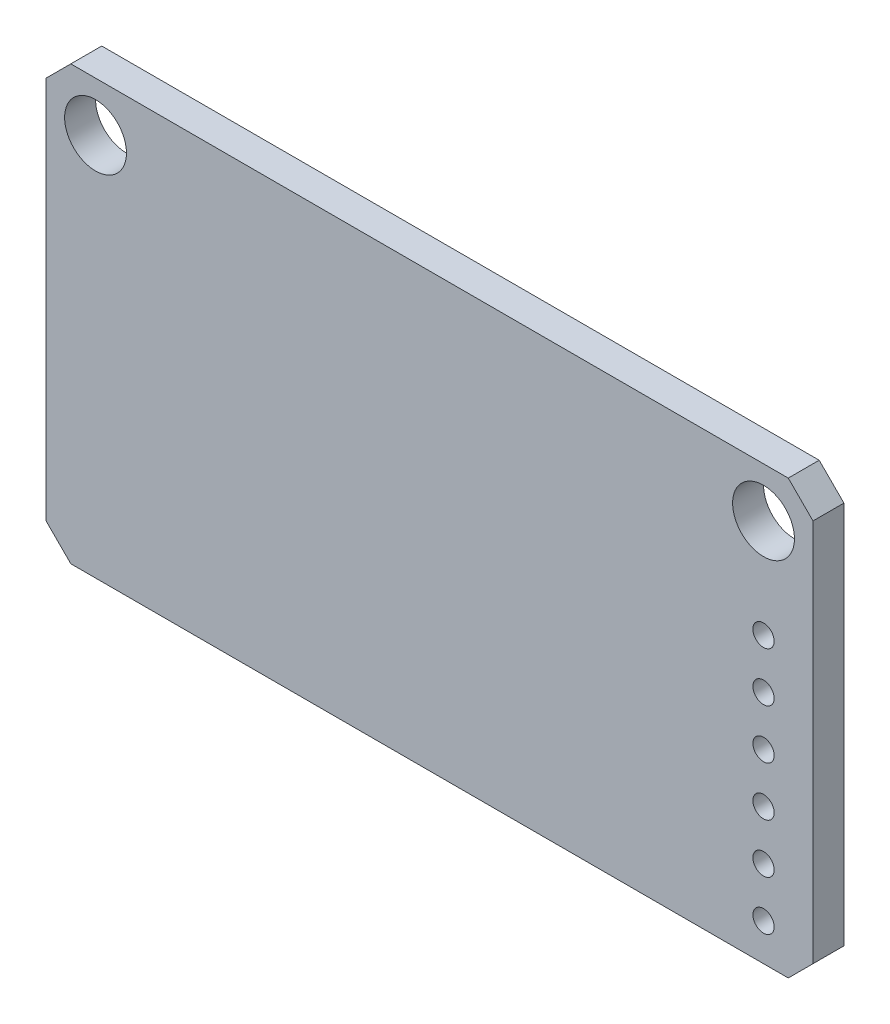
ISO-10303-21;
HEADER;
FILE_DESCRIPTION(('STEP AP214'),'2;1');
FILE_NAME('part.step','',(''),(''),'','','');
FILE_SCHEMA(('AUTOMOTIVE_DESIGN { 1 0 10303 214 1 1 1 1 }'));
ENDSEC;
DATA;
#1=APPLICATION_CONTEXT('core data for automotive mechanical design processes');
#2=APPLICATION_PROTOCOL_DEFINITION('international standard','automotive_design',2000,#1);
#3=PRODUCT_CONTEXT('',#1,'mechanical');
#4=PRODUCT('Part','Part','',(#3));
#5=PRODUCT_RELATED_PRODUCT_CATEGORY('part','',(#4));
#6=PRODUCT_DEFINITION_FORMATION('','',#4);
#7=PRODUCT_DEFINITION_CONTEXT('part definition',#1,'design');
#8=PRODUCT_DEFINITION('design','',#6,#7);
#9=PRODUCT_DEFINITION_SHAPE('','',#8);
#10=(LENGTH_UNIT() NAMED_UNIT(*) SI_UNIT(.MILLI.,.METRE.));
#11=(NAMED_UNIT(*) PLANE_ANGLE_UNIT() SI_UNIT($,.RADIAN.));
#12=(NAMED_UNIT(*) SI_UNIT($,.STERADIAN.) SOLID_ANGLE_UNIT());
#13=UNCERTAINTY_MEASURE_WITH_UNIT(LENGTH_MEASURE(1.E-05),#10,'distance_accuracy_value','');
#14=(GEOMETRIC_REPRESENTATION_CONTEXT(3) GLOBAL_UNCERTAINTY_ASSIGNED_CONTEXT((#13)) GLOBAL_UNIT_ASSIGNED_CONTEXT((#10,
#11,#12)) REPRESENTATION_CONTEXT('',''));
#15=CARTESIAN_POINT('',(0.,0.,0.));
#16=DIRECTION('',(0.,0.,1.));
#17=DIRECTION('',(1.,0.,0.));
#18=AXIS2_PLACEMENT_3D('',#15,#16,#17);
#19=CARTESIAN_POINT('',(0.,22.225,0.));
#20=DIRECTION('',(0.,0.,-1.));
#21=DIRECTION('',(-1.,0.,0.));
#22=AXIS2_PLACEMENT_3D('',#19,#20,#21);
#23=PLANE('',#22);
#24=DIRECTION('',(0.707106781186548,-0.707106781186548,0.));
#25=VECTOR('',#24,1.);
#26=CARTESIAN_POINT('',(0.,1.27,0.));
#27=LINE('',#26,#25);
#28=CARTESIAN_POINT('',(1.27,0.,0.));
#29=VERTEX_POINT('',#28);
#30=CARTESIAN_POINT('',(0.,1.27,0.));
#31=VERTEX_POINT('',#30);
#32=EDGE_CURVE('E412',#29,#31,#27,.F.);
#33=ORIENTED_EDGE('',*,*,#32,.F.);
#34=DIRECTION('',(1.,0.,0.));
#35=VECTOR('',#34,1.);
#36=CARTESIAN_POINT('',(1.27,0.,0.));
#37=LINE('',#36,#35);
#38=CARTESIAN_POINT('',(38.1,0.,0.));
#39=VERTEX_POINT('',#38);
#40=EDGE_CURVE('E417',#39,#29,#37,.F.);
#41=ORIENTED_EDGE('',*,*,#40,.F.);
#42=DIRECTION('',(0.707106781186548,0.707106781186547,0.));
#43=VECTOR('',#42,1.);
#44=CARTESIAN_POINT('',(38.1,0.,0.));
#45=LINE('',#44,#43);
#46=CARTESIAN_POINT('',(39.37,1.27,0.));
#47=VERTEX_POINT('',#46);
#48=EDGE_CURVE('E422',#47,#39,#45,.F.);
#49=ORIENTED_EDGE('',*,*,#48,.F.);
#50=DIRECTION('',(0.,1.,0.));
#51=VECTOR('',#50,1.);
#52=CARTESIAN_POINT('',(39.37,1.27,0.));
#53=LINE('',#52,#51);
#54=CARTESIAN_POINT('',(39.37,20.955,0.));
#55=VERTEX_POINT('',#54);
#56=EDGE_CURVE('E428',#55,#47,#53,.F.);
#57=ORIENTED_EDGE('',*,*,#56,.F.);
#58=DIRECTION('',(-0.707106781186548,0.707106781186548,0.));
#59=VECTOR('',#58,1.);
#60=CARTESIAN_POINT('',(38.1,22.225,0.));
#61=LINE('',#60,#59);
#62=CARTESIAN_POINT('',(38.1,22.225,0.));
#63=VERTEX_POINT('',#62);
#64=EDGE_CURVE('E432',#63,#55,#61,.F.);
#65=ORIENTED_EDGE('',*,*,#64,.F.);
#66=DIRECTION('',(-1.,0.,0.));
#67=VECTOR('',#66,1.);
#68=CARTESIAN_POINT('',(1.27,22.225,0.));
#69=LINE('',#68,#67);
#70=CARTESIAN_POINT('',(1.27,22.225,0.));
#71=VERTEX_POINT('',#70);
#72=EDGE_CURVE('E79',#71,#63,#69,.F.);
#73=ORIENTED_EDGE('',*,*,#72,.F.);
#74=DIRECTION('',(-0.707106781186547,-0.707106781186548,0.));
#75=VECTOR('',#74,1.);
#76=CARTESIAN_POINT('',(0.,20.955,0.));
#77=LINE('',#76,#75);
#78=CARTESIAN_POINT('',(0.,20.955,0.));
#79=VERTEX_POINT('',#78);
#80=EDGE_CURVE('E81',#79,#71,#77,.F.);
#81=ORIENTED_EDGE('',*,*,#80,.F.);
#82=DIRECTION('',(0.,-1.,0.));
#83=VECTOR('',#82,1.);
#84=CARTESIAN_POINT('',(0.,1.27,0.));
#85=LINE('',#84,#83);
#86=EDGE_CURVE('E84',#31,#79,#85,.F.);
#87=ORIENTED_EDGE('',*,*,#86,.F.);
#88=EDGE_LOOP('',(#33,#41,#49,#57,#65,#73,#81,#87));
#89=FACE_BOUND('',#88,.T.);
#90=CARTESIAN_POINT('',(2.54,19.685,0.));
#91=DIRECTION('',(0.,0.,1.));
#92=DIRECTION('',(1.,0.,0.));
#93=AXIS2_PLACEMENT_3D('',#90,#91,#92);
#94=CIRCLE('',#93,1.5875);
#95=CARTESIAN_POINT('',(4.1275,19.685,0.));
#96=VERTEX_POINT('',#95);
#97=EDGE_CURVE('E97',#96,#96,#94,.F.);
#98=ORIENTED_EDGE('',*,*,#97,.T.);
#99=EDGE_LOOP('',(#98));
#100=FACE_BOUND('',#99,.T.);
#101=CARTESIAN_POINT('',(36.83,19.685,0.));
#102=DIRECTION('',(0.,0.,1.));
#103=DIRECTION('',(1.,0.,0.));
#104=AXIS2_PLACEMENT_3D('',#101,#102,#103);
#105=CIRCLE('',#104,1.5875);
#106=CARTESIAN_POINT('',(38.4175,19.685,0.));
#107=VERTEX_POINT('',#106);
#108=EDGE_CURVE('E135',#107,#107,#105,.F.);
#109=ORIENTED_EDGE('',*,*,#108,.T.);
#110=EDGE_LOOP('',(#109));
#111=FACE_BOUND('',#110,.T.);
#112=CARTESIAN_POINT('',(36.83,1.905,0.));
#113=DIRECTION('',(0.,0.,1.));
#114=DIRECTION('',(1.,0.,0.));
#115=AXIS2_PLACEMENT_3D('',#112,#113,#114);
#116=CIRCLE('',#115,0.546100000000001);
#117=CARTESIAN_POINT('',(37.3761,1.905,0.));
#118=VERTEX_POINT('',#117);
#119=EDGE_CURVE('E138',#118,#118,#116,.F.);
#120=ORIENTED_EDGE('',*,*,#119,.T.);
#121=EDGE_LOOP('',(#120));
#122=FACE_BOUND('',#121,.T.);
#123=CARTESIAN_POINT('',(36.83,4.445,0.));
#124=DIRECTION('',(0.,0.,1.));
#125=DIRECTION('',(1.,0.,0.));
#126=AXIS2_PLACEMENT_3D('',#123,#124,#125);
#127=CIRCLE('',#126,0.546099999999994);
#128=CARTESIAN_POINT('',(37.3761,4.445,0.));
#129=VERTEX_POINT('',#128);
#130=EDGE_CURVE('E141',#129,#129,#127,.F.);
#131=ORIENTED_EDGE('',*,*,#130,.T.);
#132=EDGE_LOOP('',(#131));
#133=FACE_BOUND('',#132,.T.);
#134=CARTESIAN_POINT('',(36.83,6.985,0.));
#135=DIRECTION('',(0.,0.,1.));
#136=DIRECTION('',(1.,0.,0.));
#137=AXIS2_PLACEMENT_3D('',#134,#135,#136);
#138=CIRCLE('',#137,0.546100000000001);
#139=CARTESIAN_POINT('',(37.3761,6.985,0.));
#140=VERTEX_POINT('',#139);
#141=EDGE_CURVE('E144',#140,#140,#138,.F.);
#142=ORIENTED_EDGE('',*,*,#141,.T.);
#143=EDGE_LOOP('',(#142));
#144=FACE_BOUND('',#143,.T.);
#145=CARTESIAN_POINT('',(36.83,9.525,0.));
#146=DIRECTION('',(0.,0.,1.));
#147=DIRECTION('',(1.,0.,0.));
#148=AXIS2_PLACEMENT_3D('',#145,#146,#147);
#149=CIRCLE('',#148,0.546100000000001);
#150=CARTESIAN_POINT('',(37.3761,9.525,0.));
#151=VERTEX_POINT('',#150);
#152=EDGE_CURVE('E147',#151,#151,#149,.F.);
#153=ORIENTED_EDGE('',*,*,#152,.T.);
#154=EDGE_LOOP('',(#153));
#155=FACE_BOUND('',#154,.T.);
#156=CARTESIAN_POINT('',(36.83,12.065,0.));
#157=DIRECTION('',(0.,0.,1.));
#158=DIRECTION('',(1.,0.,0.));
#159=AXIS2_PLACEMENT_3D('',#156,#157,#158);
#160=CIRCLE('',#159,0.546100000000001);
#161=CARTESIAN_POINT('',(37.3761,12.065,0.));
#162=VERTEX_POINT('',#161);
#163=EDGE_CURVE('E149',#162,#162,#160,.F.);
#164=ORIENTED_EDGE('',*,*,#163,.T.);
#165=EDGE_LOOP('',(#164));
#166=FACE_BOUND('',#165,.T.);
#167=CARTESIAN_POINT('',(36.83,14.605,0.));
#168=DIRECTION('',(0.,0.,1.));
#169=DIRECTION('',(1.,0.,0.));
#170=AXIS2_PLACEMENT_3D('',#167,#168,#169);
#171=CIRCLE('',#170,0.546100000000001);
#172=CARTESIAN_POINT('',(37.3761,14.605,0.));
#173=VERTEX_POINT('',#172);
#174=EDGE_CURVE('E19',#173,#173,#171,.F.);
#175=ORIENTED_EDGE('',*,*,#174,.T.);
#176=EDGE_LOOP('',(#175));
#177=FACE_BOUND('',#176,.T.);
#178=ADVANCED_FACE('F16',(#89,#100,#111,#122,#133,#144,#155,#166,#177),#23,.F.);
#179=CARTESIAN_POINT('',(36.83,14.605,-1.58749999999999));
#180=DIRECTION('',(0.,0.,1.));
#181=DIRECTION('',(1.,0.,0.));
#182=AXIS2_PLACEMENT_3D('',#179,#180,#181);
#183=CYLINDRICAL_SURFACE('',#182,0.546100000000001);
#184=ORIENTED_EDGE('',*,*,#174,.F.);
#185=EDGE_LOOP('',(#184));
#186=FACE_BOUND('',#185,.T.);
#187=CARTESIAN_POINT('',(36.83,14.605,-1.58749999999999));
#188=DIRECTION('',(0.,0.,1.));
#189=DIRECTION('',(1.,0.,0.));
#190=AXIS2_PLACEMENT_3D('',#187,#188,#189);
#191=CIRCLE('',#190,0.546100000000001);
#192=CARTESIAN_POINT('',(37.3761,14.605,-1.58749999999999));
#193=VERTEX_POINT('',#192);
#194=EDGE_CURVE('E130',#193,#193,#191,.T.);
#195=ORIENTED_EDGE('',*,*,#194,.F.);
#196=EDGE_LOOP('',(#195));
#197=FACE_BOUND('',#196,.T.);
#198=ADVANCED_FACE('F157',(#186,#197),#183,.F.);
#199=CARTESIAN_POINT('',(36.83,12.065,-1.58749999999999));
#200=DIRECTION('',(0.,0.,1.));
#201=DIRECTION('',(1.,0.,0.));
#202=AXIS2_PLACEMENT_3D('',#199,#200,#201);
#203=CYLINDRICAL_SURFACE('',#202,0.546100000000001);
#204=ORIENTED_EDGE('',*,*,#163,.F.);
#205=EDGE_LOOP('',(#204));
#206=FACE_BOUND('',#205,.T.);
#207=CARTESIAN_POINT('',(36.83,12.065,-1.58749999999999));
#208=DIRECTION('',(0.,0.,1.));
#209=DIRECTION('',(1.,0.,0.));
#210=AXIS2_PLACEMENT_3D('',#207,#208,#209);
#211=CIRCLE('',#210,0.546100000000001);
#212=CARTESIAN_POINT('',(37.3761,12.065,-1.58749999999999));
#213=VERTEX_POINT('',#212);
#214=EDGE_CURVE('E127',#213,#213,#211,.T.);
#215=ORIENTED_EDGE('',*,*,#214,.F.);
#216=EDGE_LOOP('',(#215));
#217=FACE_BOUND('',#216,.T.);
#218=ADVANCED_FACE('F160',(#206,#217),#203,.F.);
#219=CARTESIAN_POINT('',(36.83,9.525,-1.58749999999999));
#220=DIRECTION('',(0.,0.,1.));
#221=DIRECTION('',(1.,0.,0.));
#222=AXIS2_PLACEMENT_3D('',#219,#220,#221);
#223=CYLINDRICAL_SURFACE('',#222,0.546100000000001);
#224=ORIENTED_EDGE('',*,*,#152,.F.);
#225=EDGE_LOOP('',(#224));
#226=FACE_BOUND('',#225,.T.);
#227=CARTESIAN_POINT('',(36.83,9.525,-1.58749999999999));
#228=DIRECTION('',(0.,0.,1.));
#229=DIRECTION('',(1.,0.,0.));
#230=AXIS2_PLACEMENT_3D('',#227,#228,#229);
#231=CIRCLE('',#230,0.546100000000001);
#232=CARTESIAN_POINT('',(37.3761,9.525,-1.58749999999999));
#233=VERTEX_POINT('',#232);
#234=EDGE_CURVE('E124',#233,#233,#231,.T.);
#235=ORIENTED_EDGE('',*,*,#234,.F.);
#236=EDGE_LOOP('',(#235));
#237=FACE_BOUND('',#236,.T.);
#238=ADVANCED_FACE('F219',(#226,#237),#223,.F.);
#239=CARTESIAN_POINT('',(36.83,6.985,-1.58749999999999));
#240=DIRECTION('',(0.,0.,1.));
#241=DIRECTION('',(1.,0.,0.));
#242=AXIS2_PLACEMENT_3D('',#239,#240,#241);
#243=CYLINDRICAL_SURFACE('',#242,0.546100000000001);
#244=ORIENTED_EDGE('',*,*,#141,.F.);
#245=EDGE_LOOP('',(#244));
#246=FACE_BOUND('',#245,.T.);
#247=CARTESIAN_POINT('',(36.83,6.985,-1.58749999999999));
#248=DIRECTION('',(0.,0.,1.));
#249=DIRECTION('',(1.,0.,0.));
#250=AXIS2_PLACEMENT_3D('',#247,#248,#249);
#251=CIRCLE('',#250,0.546100000000001);
#252=CARTESIAN_POINT('',(37.3761,6.985,-1.58749999999999));
#253=VERTEX_POINT('',#252);
#254=EDGE_CURVE('E121',#253,#253,#251,.T.);
#255=ORIENTED_EDGE('',*,*,#254,.F.);
#256=EDGE_LOOP('',(#255));
#257=FACE_BOUND('',#256,.T.);
#258=ADVANCED_FACE('F215',(#246,#257),#243,.F.);
#259=CARTESIAN_POINT('',(36.83,4.445,-1.58749999999999));
#260=DIRECTION('',(0.,0.,1.));
#261=DIRECTION('',(1.,0.,0.));
#262=AXIS2_PLACEMENT_3D('',#259,#260,#261);
#263=CYLINDRICAL_SURFACE('',#262,0.546099999999994);
#264=ORIENTED_EDGE('',*,*,#130,.F.);
#265=EDGE_LOOP('',(#264));
#266=FACE_BOUND('',#265,.T.);
#267=CARTESIAN_POINT('',(36.83,4.445,-1.58749999999999));
#268=DIRECTION('',(0.,0.,1.));
#269=DIRECTION('',(1.,0.,0.));
#270=AXIS2_PLACEMENT_3D('',#267,#268,#269);
#271=CIRCLE('',#270,0.546099999999994);
#272=CARTESIAN_POINT('',(37.3761,4.445,-1.58749999999999));
#273=VERTEX_POINT('',#272);
#274=EDGE_CURVE('E118',#273,#273,#271,.T.);
#275=ORIENTED_EDGE('',*,*,#274,.F.);
#276=EDGE_LOOP('',(#275));
#277=FACE_BOUND('',#276,.T.);
#278=ADVANCED_FACE('F211',(#266,#277),#263,.F.);
#279=CARTESIAN_POINT('',(36.83,1.905,-1.58749999999999));
#280=DIRECTION('',(0.,0.,1.));
#281=DIRECTION('',(1.,0.,0.));
#282=AXIS2_PLACEMENT_3D('',#279,#280,#281);
#283=CYLINDRICAL_SURFACE('',#282,0.546100000000001);
#284=ORIENTED_EDGE('',*,*,#119,.F.);
#285=EDGE_LOOP('',(#284));
#286=FACE_BOUND('',#285,.T.);
#287=CARTESIAN_POINT('',(36.83,1.905,-1.58749999999999));
#288=DIRECTION('',(0.,0.,1.));
#289=DIRECTION('',(1.,0.,0.));
#290=AXIS2_PLACEMENT_3D('',#287,#288,#289);
#291=CIRCLE('',#290,0.546100000000001);
#292=CARTESIAN_POINT('',(37.3761,1.905,-1.58749999999999));
#293=VERTEX_POINT('',#292);
#294=EDGE_CURVE('E115',#293,#293,#291,.T.);
#295=ORIENTED_EDGE('',*,*,#294,.F.);
#296=EDGE_LOOP('',(#295));
#297=FACE_BOUND('',#296,.T.);
#298=ADVANCED_FACE('F207',(#286,#297),#283,.F.);
#299=CARTESIAN_POINT('',(36.83,19.685,-1.58749999999999));
#300=DIRECTION('',(0.,0.,1.));
#301=DIRECTION('',(1.,0.,0.));
#302=AXIS2_PLACEMENT_3D('',#299,#300,#301);
#303=CYLINDRICAL_SURFACE('',#302,1.5875);
#304=ORIENTED_EDGE('',*,*,#108,.F.);
#305=EDGE_LOOP('',(#304));
#306=FACE_BOUND('',#305,.T.);
#307=CARTESIAN_POINT('',(36.83,19.685,-1.58749999999999));
#308=DIRECTION('',(0.,0.,1.));
#309=DIRECTION('',(1.,0.,0.));
#310=AXIS2_PLACEMENT_3D('',#307,#308,#309);
#311=CIRCLE('',#310,1.5875);
#312=CARTESIAN_POINT('',(38.4175,19.685,-1.58749999999999));
#313=VERTEX_POINT('',#312);
#314=EDGE_CURVE('E112',#313,#313,#311,.T.);
#315=ORIENTED_EDGE('',*,*,#314,.F.);
#316=EDGE_LOOP('',(#315));
#317=FACE_BOUND('',#316,.T.);
#318=ADVANCED_FACE('F203',(#306,#317),#303,.F.);
#319=CARTESIAN_POINT('',(2.54,19.685,-1.58749999999999));
#320=DIRECTION('',(0.,0.,1.));
#321=DIRECTION('',(1.,0.,0.));
#322=AXIS2_PLACEMENT_3D('',#319,#320,#321);
#323=CYLINDRICAL_SURFACE('',#322,1.5875);
#324=ORIENTED_EDGE('',*,*,#97,.F.);
#325=EDGE_LOOP('',(#324));
#326=FACE_BOUND('',#325,.T.);
#327=CARTESIAN_POINT('',(2.54,19.685,-1.58749999999999));
#328=DIRECTION('',(0.,0.,1.));
#329=DIRECTION('',(1.,0.,0.));
#330=AXIS2_PLACEMENT_3D('',#327,#328,#329);
#331=CIRCLE('',#330,1.5875);
#332=CARTESIAN_POINT('',(4.1275,19.685,-1.58749999999999));
#333=VERTEX_POINT('',#332);
#334=EDGE_CURVE('E108',#333,#333,#331,.T.);
#335=ORIENTED_EDGE('',*,*,#334,.F.);
#336=EDGE_LOOP('',(#335));
#337=FACE_BOUND('',#336,.T.);
#338=ADVANCED_FACE('F200',(#326,#337),#323,.F.);
#339=CARTESIAN_POINT('',(0.,1.27,-1.58749999999999));
#340=DIRECTION('',(-1.,0.,0.));
#341=DIRECTION('',(0.,-1.,0.));
#342=AXIS2_PLACEMENT_3D('',#339,#340,#341);
#343=PLANE('',#342);
#344=DIRECTION('',(0.,1.,0.));
#345=VECTOR('',#344,1.);
#346=CARTESIAN_POINT('',(0.,22.225,-1.58749999999999));
#347=LINE('',#346,#345);
#348=CARTESIAN_POINT('',(0.,1.27,-1.58749999999999));
#349=VERTEX_POINT('',#348);
#350=CARTESIAN_POINT('',(0.,20.955,-1.58749999999999));
#351=VERTEX_POINT('',#350);
#352=EDGE_CURVE('E111',#349,#351,#347,.T.);
#353=ORIENTED_EDGE('',*,*,#352,.F.);
#354=DIRECTION('',(0.,0.,1.));
#355=VECTOR('',#354,1.);
#356=CARTESIAN_POINT('',(0.,1.27,-1.58749999999999));
#357=LINE('',#356,#355);
#358=EDGE_CURVE('E95',#31,#349,#357,.F.);
#359=ORIENTED_EDGE('',*,*,#358,.F.);
#360=ORIENTED_EDGE('',*,*,#86,.T.);
#361=DIRECTION('',(0.,0.,1.));
#362=VECTOR('',#361,1.);
#363=CARTESIAN_POINT('',(0.,20.955,-1.58749999999999));
#364=LINE('',#363,#362);
#365=EDGE_CURVE('E89',#351,#79,#364,.T.);
#366=ORIENTED_EDGE('',*,*,#365,.F.);
#367=EDGE_LOOP('',(#353,#359,#360,#366));
#368=FACE_BOUND('',#367,.T.);
#369=ADVANCED_FACE('F92',(#368),#343,.T.);
#370=CARTESIAN_POINT('',(0.,20.955,-1.58749999999999));
#371=DIRECTION('',(-0.707106781186548,0.707106781186547,0.));
#372=DIRECTION('',(-0.707106781186547,-0.707106781186548,0.));
#373=AXIS2_PLACEMENT_3D('',#370,#371,#372);
#374=PLANE('',#373);
#375=DIRECTION('',(0.707106781186549,0.707106781186546,0.));
#376=VECTOR('',#375,1.);
#377=CARTESIAN_POINT('',(0.,20.955,-1.58749999999999));
#378=LINE('',#377,#376);
#379=CARTESIAN_POINT('',(1.27,22.225,-1.58749999999999));
#380=VERTEX_POINT('',#379);
#381=EDGE_CURVE('E101',#351,#380,#378,.T.);
#382=ORIENTED_EDGE('',*,*,#381,.F.);
#383=ORIENTED_EDGE('',*,*,#365,.T.);
#384=ORIENTED_EDGE('',*,*,#80,.T.);
#385=DIRECTION('',(0.,0.,1.));
#386=VECTOR('',#385,1.);
#387=CARTESIAN_POINT('',(1.27,22.225,-1.58749999999999));
#388=LINE('',#387,#386);
#389=EDGE_CURVE('E104',#380,#71,#388,.T.);
#390=ORIENTED_EDGE('',*,*,#389,.F.);
#391=EDGE_LOOP('',(#382,#383,#384,#390));
#392=FACE_BOUND('',#391,.T.);
#393=ADVANCED_FACE('F99',(#392),#374,.T.);
#394=CARTESIAN_POINT('',(1.27,22.225,-1.58749999999999));
#395=DIRECTION('',(0.,1.,0.));
#396=DIRECTION('',(-1.,0.,0.));
#397=AXIS2_PLACEMENT_3D('',#394,#395,#396);
#398=PLANE('',#397);
#399=DIRECTION('',(-1.,0.,0.));
#400=VECTOR('',#399,1.);
#401=CARTESIAN_POINT('',(0.,22.225,-1.58749999999999));
#402=LINE('',#401,#400);
#403=CARTESIAN_POINT('',(38.1,22.225,-1.58749999999999));
#404=VERTEX_POINT('',#403);
#405=EDGE_CURVE('E399',#380,#404,#402,.F.);
#406=ORIENTED_EDGE('',*,*,#405,.F.);
#407=ORIENTED_EDGE('',*,*,#389,.T.);
#408=ORIENTED_EDGE('',*,*,#72,.T.);
#409=DIRECTION('',(0.,0.,1.));
#410=VECTOR('',#409,1.);
#411=CARTESIAN_POINT('',(38.1,22.225,-1.58749999999999));
#412=LINE('',#411,#410);
#413=EDGE_CURVE('E401',#404,#63,#412,.T.);
#414=ORIENTED_EDGE('',*,*,#413,.F.);
#415=EDGE_LOOP('',(#406,#407,#408,#414));
#416=FACE_BOUND('',#415,.T.);
#417=ADVANCED_FACE('F191',(#416),#398,.T.);
#418=CARTESIAN_POINT('',(38.1,22.225,-1.58749999999999));
#419=DIRECTION('',(0.707106781186548,0.707106781186548,0.));
#420=DIRECTION('',(-0.707106781186548,0.707106781186548,0.));
#421=AXIS2_PLACEMENT_3D('',#418,#419,#420);
#422=PLANE('',#421);
#423=DIRECTION('',(0.707106781186546,-0.70710678118655,0.));
#424=VECTOR('',#423,1.);
#425=CARTESIAN_POINT('',(38.1,22.225,-1.58749999999999));
#426=LINE('',#425,#424);
#427=CARTESIAN_POINT('',(39.37,20.955,-1.58749999999999));
#428=VERTEX_POINT('',#427);
#429=EDGE_CURVE('E404',#404,#428,#426,.T.);
#430=ORIENTED_EDGE('',*,*,#429,.F.);
#431=ORIENTED_EDGE('',*,*,#413,.T.);
#432=ORIENTED_EDGE('',*,*,#64,.T.);
#433=DIRECTION('',(0.,0.,1.));
#434=VECTOR('',#433,1.);
#435=CARTESIAN_POINT('',(39.37,20.955,-1.58749999999999));
#436=LINE('',#435,#434);
#437=EDGE_CURVE('E425',#428,#55,#436,.T.);
#438=ORIENTED_EDGE('',*,*,#437,.F.);
#439=EDGE_LOOP('',(#430,#431,#432,#438));
#440=FACE_BOUND('',#439,.T.);
#441=ADVANCED_FACE('F187',(#440),#422,.T.);
#442=CARTESIAN_POINT('',(39.37,1.27,-1.58749999999999));
#443=DIRECTION('',(1.,0.,0.));
#444=DIRECTION('',(0.,1.,0.));
#445=AXIS2_PLACEMENT_3D('',#442,#443,#444);
#446=PLANE('',#445);
#447=DIRECTION('',(0.,1.,0.));
#448=VECTOR('',#447,1.);
#449=CARTESIAN_POINT('',(39.37,22.225,-1.58749999999999));
#450=LINE('',#449,#448);
#451=CARTESIAN_POINT('',(39.37,1.27,-1.58749999999999));
#452=VERTEX_POINT('',#451);
#453=EDGE_CURVE('E436',#428,#452,#450,.F.);
#454=ORIENTED_EDGE('',*,*,#453,.F.);
#455=ORIENTED_EDGE('',*,*,#437,.T.);
#456=ORIENTED_EDGE('',*,*,#56,.T.);
#457=DIRECTION('',(0.,0.,1.));
#458=VECTOR('',#457,1.);
#459=CARTESIAN_POINT('',(39.37,1.27000000000001,-1.58749999999999));
#460=LINE('',#459,#458);
#461=EDGE_CURVE('E419',#452,#47,#460,.T.);
#462=ORIENTED_EDGE('',*,*,#461,.F.);
#463=EDGE_LOOP('',(#454,#455,#456,#462));
#464=FACE_BOUND('',#463,.T.);
#465=ADVANCED_FACE('F183',(#464),#446,.T.);
#466=CARTESIAN_POINT('',(38.1,0.,-1.58749999999999));
#467=DIRECTION('',(0.707106781186547,-0.707106781186548,0.));
#468=DIRECTION('',(0.707106781186548,0.707106781186547,0.));
#469=AXIS2_PLACEMENT_3D('',#466,#467,#468);
#470=PLANE('',#469);
#471=DIRECTION('',(-0.707106781186549,-0.707106781186546,0.));
#472=VECTOR('',#471,1.);
#473=CARTESIAN_POINT('',(39.37,1.27,-1.58749999999999));
#474=LINE('',#473,#472);
#475=CARTESIAN_POINT('',(38.1,0.,-1.58749999999999));
#476=VERTEX_POINT('',#475);
#477=EDGE_CURVE('E439',#452,#476,#474,.T.);
#478=ORIENTED_EDGE('',*,*,#477,.F.);
#479=ORIENTED_EDGE('',*,*,#461,.T.);
#480=ORIENTED_EDGE('',*,*,#48,.T.);
#481=DIRECTION('',(0.,0.,1.));
#482=VECTOR('',#481,1.);
#483=CARTESIAN_POINT('',(38.1,0.,-1.58749999999999));
#484=LINE('',#483,#482);
#485=EDGE_CURVE('E414',#476,#39,#484,.T.);
#486=ORIENTED_EDGE('',*,*,#485,.F.);
#487=EDGE_LOOP('',(#478,#479,#480,#486));
#488=FACE_BOUND('',#487,.T.);
#489=ADVANCED_FACE('F180',(#488),#470,.T.);
#490=CARTESIAN_POINT('',(1.27,0.,-1.58749999999999));
#491=DIRECTION('',(0.,-1.,0.));
#492=DIRECTION('',(1.,0.,0.));
#493=AXIS2_PLACEMENT_3D('',#490,#491,#492);
#494=PLANE('',#493);
#495=DIRECTION('',(-1.,0.,0.));
#496=VECTOR('',#495,1.);
#497=CARTESIAN_POINT('',(0.,0.,-1.58749999999999));
#498=LINE('',#497,#496);
#499=CARTESIAN_POINT('',(1.27,0.,-1.58749999999999));
#500=VERTEX_POINT('',#499);
#501=EDGE_CURVE('E25',#476,#500,#498,.T.);
#502=ORIENTED_EDGE('',*,*,#501,.F.);
#503=ORIENTED_EDGE('',*,*,#485,.T.);
#504=ORIENTED_EDGE('',*,*,#40,.T.);
#505=DIRECTION('',(0.,0.,1.));
#506=VECTOR('',#505,1.);
#507=CARTESIAN_POINT('',(1.27,0.,-1.58749999999999));
#508=LINE('',#507,#506);
#509=EDGE_CURVE('E34',#500,#29,#508,.T.);
#510=ORIENTED_EDGE('',*,*,#509,.F.);
#511=EDGE_LOOP('',(#502,#503,#504,#510));
#512=FACE_BOUND('',#511,.T.);
#513=ADVANCED_FACE('F172',(#512),#494,.T.);
#514=CARTESIAN_POINT('',(0.,1.27,-1.58749999999999));
#515=DIRECTION('',(-0.707106781186548,-0.707106781186548,0.));
#516=DIRECTION('',(0.707106781186548,-0.707106781186548,0.));
#517=AXIS2_PLACEMENT_3D('',#514,#515,#516);
#518=PLANE('',#517);
#519=DIRECTION('',(-0.707106781186548,0.707106781186548,0.));
#520=VECTOR('',#519,1.);
#521=CARTESIAN_POINT('',(1.27,0.,-1.58749999999999));
#522=LINE('',#521,#520);
#523=EDGE_CURVE('E11',#500,#349,#522,.T.);
#524=ORIENTED_EDGE('',*,*,#523,.F.);
#525=ORIENTED_EDGE('',*,*,#509,.T.);
#526=ORIENTED_EDGE('',*,*,#32,.T.);
#527=ORIENTED_EDGE('',*,*,#358,.T.);
#528=EDGE_LOOP('',(#524,#525,#526,#527));
#529=FACE_BOUND('',#528,.T.);
#530=ADVANCED_FACE('F165',(#529),#518,.T.);
#531=CARTESIAN_POINT('',(0.,22.225,-1.58749999999999));
#532=DIRECTION('',(0.,0.,-1.));
#533=DIRECTION('',(-1.,0.,0.));
#534=AXIS2_PLACEMENT_3D('',#531,#532,#533);
#535=PLANE('',#534);
#536=ORIENTED_EDGE('',*,*,#501,.T.);
#537=ORIENTED_EDGE('',*,*,#523,.T.);
#538=ORIENTED_EDGE('',*,*,#352,.T.);
#539=ORIENTED_EDGE('',*,*,#381,.T.);
#540=ORIENTED_EDGE('',*,*,#405,.T.);
#541=ORIENTED_EDGE('',*,*,#429,.T.);
#542=ORIENTED_EDGE('',*,*,#453,.T.);
#543=ORIENTED_EDGE('',*,*,#477,.T.);
#544=EDGE_LOOP('',(#536,#537,#538,#539,#540,#541,#542,#543));
#545=FACE_BOUND('',#544,.T.);
#546=ORIENTED_EDGE('',*,*,#334,.T.);
#547=EDGE_LOOP('',(#546));
#548=FACE_BOUND('',#547,.T.);
#549=ORIENTED_EDGE('',*,*,#314,.T.);
#550=EDGE_LOOP('',(#549));
#551=FACE_BOUND('',#550,.T.);
#552=ORIENTED_EDGE('',*,*,#294,.T.);
#553=EDGE_LOOP('',(#552));
#554=FACE_BOUND('',#553,.T.);
#555=ORIENTED_EDGE('',*,*,#274,.T.);
#556=EDGE_LOOP('',(#555));
#557=FACE_BOUND('',#556,.T.);
#558=ORIENTED_EDGE('',*,*,#254,.T.);
#559=EDGE_LOOP('',(#558));
#560=FACE_BOUND('',#559,.T.);
#561=ORIENTED_EDGE('',*,*,#234,.T.);
#562=EDGE_LOOP('',(#561));
#563=FACE_BOUND('',#562,.T.);
#564=ORIENTED_EDGE('',*,*,#214,.T.);
#565=EDGE_LOOP('',(#564));
#566=FACE_BOUND('',#565,.T.);
#567=ORIENTED_EDGE('',*,*,#194,.T.);
#568=EDGE_LOOP('',(#567));
#569=FACE_BOUND('',#568,.T.);
#570=ADVANCED_FACE('F163',(#545,#548,#551,#554,#557,#560,#563,#566,#569),#535,.T.);
#571=CLOSED_SHELL('',(#178,#198,#218,#238,#258,#278,#298,#318,#338,#369,#393,#417,#441,#465,
#489,#513,#530,#570));
#572=MANIFOLD_SOLID_BREP('B1',#571);
#573=ADVANCED_BREP_SHAPE_REPRESENTATION('',(#18,#572),#14);
#574=SHAPE_DEFINITION_REPRESENTATION(#9,#573);
ENDSEC;
END-ISO-10303-21;
